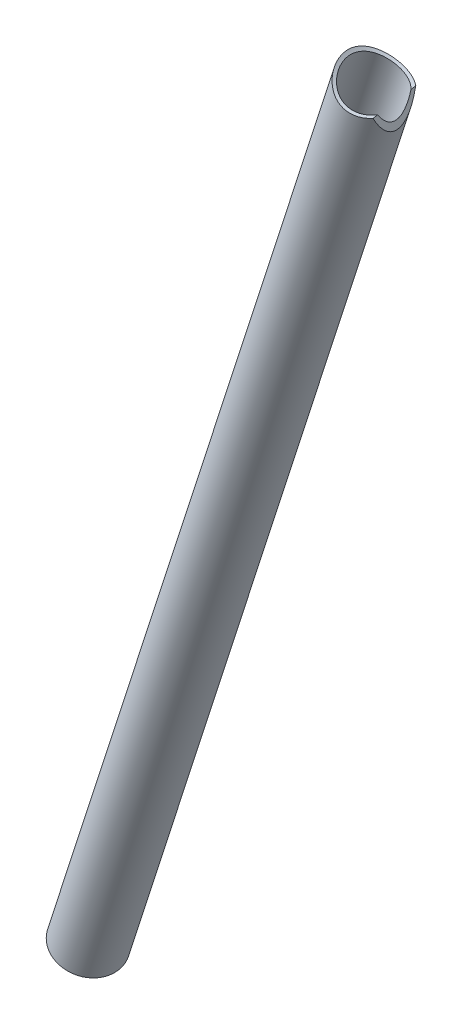
ISO-10303-21;
HEADER;
FILE_DESCRIPTION(('STEP AP214'),'2;1');
FILE_NAME('part.step','',(''),(''),'','','');
FILE_SCHEMA(('AUTOMOTIVE_DESIGN { 1 0 10303 214 1 1 1 1 }'));
ENDSEC;
DATA;
#1=APPLICATION_CONTEXT('core data for automotive mechanical design processes');
#2=APPLICATION_PROTOCOL_DEFINITION('international standard','automotive_design',2000,#1);
#3=PRODUCT_CONTEXT('',#1,'mechanical');
#4=PRODUCT('Part','Part','',(#3));
#5=PRODUCT_RELATED_PRODUCT_CATEGORY('part','',(#4));
#6=PRODUCT_DEFINITION_FORMATION('','',#4);
#7=PRODUCT_DEFINITION_CONTEXT('part definition',#1,'design');
#8=PRODUCT_DEFINITION('design','',#6,#7);
#9=PRODUCT_DEFINITION_SHAPE('','',#8);
#10=(LENGTH_UNIT() NAMED_UNIT(*) SI_UNIT(.MILLI.,.METRE.));
#11=(NAMED_UNIT(*) PLANE_ANGLE_UNIT() SI_UNIT($,.RADIAN.));
#12=(NAMED_UNIT(*) SI_UNIT($,.STERADIAN.) SOLID_ANGLE_UNIT());
#13=UNCERTAINTY_MEASURE_WITH_UNIT(LENGTH_MEASURE(1.E-05),#10,'distance_accuracy_value','');
#14=(GEOMETRIC_REPRESENTATION_CONTEXT(3) GLOBAL_UNCERTAINTY_ASSIGNED_CONTEXT((#13)) GLOBAL_UNIT_ASSIGNED_CONTEXT((#10,
#11,#12)) REPRESENTATION_CONTEXT('',''));
#15=CARTESIAN_POINT('',(0.,0.,0.));
#16=DIRECTION('',(0.,0.,1.));
#17=DIRECTION('',(1.,0.,0.));
#18=AXIS2_PLACEMENT_3D('',#15,#16,#17);
#19=CARTESIAN_POINT('',(15.0351503322684,521.737226724999,283.725227880223));
#20=DIRECTION('',(-0.025807832155009,0.13067423307069,-0.991089400917418));
#21=DIRECTION('',(-0.0275402605355425,0.99095038035367,0.131373047945732));
#22=AXIS2_PLACEMENT_3D('',#19,#20,#21);
#23=CYLINDRICAL_SURFACE('',#22,11.1125);
#24=CARTESIAN_POINT('',(17.7249998550725,509.907165659873,290.571441380771));
#25=CARTESIAN_POINT('',(17.714859230387,509.882073618332,290.736544047308));
#26=CARTESIAN_POINT('',(17.696907883389,509.855306384026,290.900855129583));
#27=CARTESIAN_POINT('',(17.6458903359661,509.799019876215,291.226688075342));
#28=CARTESIAN_POINT('',(17.6128202475326,509.769499896357,291.388209210254));
#29=CARTESIAN_POINT('',(17.5322574615317,509.708476961237,291.707417176691));
#30=CARTESIAN_POINT('',(17.4847483811448,509.67697178588,291.865099431876));
#31=CARTESIAN_POINT('',(17.376251635094,509.612936261837,292.175557086168));
#32=CARTESIAN_POINT('',(17.3152576661517,509.580405439848,292.328330152184));
#33=CARTESIAN_POINT('',(17.1145149644403,509.483259359491,292.775903107981));
#34=CARTESIAN_POINT('',(16.9562980389727,509.418546970786,293.062654205853));
#35=CARTESIAN_POINT('',(16.6878525960758,509.327274141793,293.473053956822));
#36=CARTESIAN_POINT('',(16.5931412758415,509.297805508225,293.606614085974));
#37=CARTESIAN_POINT('',(16.3941029245154,509.241685477939,293.866998838918));
#38=CARTESIAN_POINT('',(16.289775359966,509.215034237691,293.993823088422));
#39=CARTESIAN_POINT('',(15.9374228086864,509.134745421652,294.393241363527));
#40=CARTESIAN_POINT('',(15.6713683353596,509.088535725302,294.651964655292));
#41=CARTESIAN_POINT('',(15.2453680192188,509.040339512259,295.010240139479));
#42=CARTESIAN_POINT('',(15.0987607485816,509.027792354862,295.124772149783));
#43=CARTESIAN_POINT('',(14.7974877046064,509.010806345952,295.343345775861));
#44=CARTESIAN_POINT('',(14.6428254971652,509.00636393735,295.447391974795));
#45=CARTESIAN_POINT('',(14.3205551725308,509.006606728922,295.648014931001));
#46=CARTESIAN_POINT('',(14.1526786931881,509.011643257261,295.744160747586));
#47=CARTESIAN_POINT('',(13.8108651889369,509.032534295837,295.923494322964));
#48=CARTESIAN_POINT('',(13.6369311121472,509.048383611626,296.006688280254));
#49=CARTESIAN_POINT('',(13.2846121958187,509.091690144634,296.159205827002));
#50=CARTESIAN_POINT('',(13.106230547351,509.119139252566,296.228539056558));
#51=CARTESIAN_POINT('',(12.7466719058673,509.186194076586,296.352517217029));
#52=CARTESIAN_POINT('',(12.565495385847,509.225797756647,296.407164605112));
#53=CARTESIAN_POINT('',(12.2236116902249,509.311993701609,296.495497156791));
#54=CARTESIAN_POINT('',(12.0629989111602,509.357219374487,296.530890235535));
#55=CARTESIAN_POINT('',(11.7424891546355,509.457206362689,296.589240167673));
#56=CARTESIAN_POINT('',(11.5825921042142,509.511966682249,296.612198318699));
#57=CARTESIAN_POINT('',(11.2649691816409,509.630663827024,296.645422112562));
#58=CARTESIAN_POINT('',(11.1072425231125,509.694597227294,296.655692478933));
#59=CARTESIAN_POINT('',(10.7952458935019,509.831081901543,296.66347930387));
#60=CARTESIAN_POINT('',(10.6409757923459,509.903632850586,296.660996243175));
#61=CARTESIAN_POINT('',(10.3500547245036,510.050057214387,296.644129719961));
#62=CARTESIAN_POINT('',(10.213021115731,510.123293431816,296.630776279434));
#63=CARTESIAN_POINT('',(9.94364829601323,510.275625745229,296.593668789171));
#64=CARTESIAN_POINT('',(9.81131056026035,510.354723658961,296.56991150183));
#65=CARTESIAN_POINT('',(9.55210108736376,510.517929260651,296.512285905842));
#66=CARTESIAN_POINT('',(9.42522781582895,510.602035526277,296.47842045697));
#67=CARTESIAN_POINT('',(9.17740376792828,510.774451172544,296.400907630534));
#68=CARTESIAN_POINT('',(9.05645532267624,510.862762181011,296.357256439858));
#69=CARTESIAN_POINT('',(8.81534180101823,511.046950348102,296.258257643286));
#70=CARTESIAN_POINT('',(8.69548654049987,511.14298766616,296.202453120458));
#71=CARTESIAN_POINT('',(8.46308098007153,511.337654626577,296.080971174874));
#72=CARTESIAN_POINT('',(8.35053318409066,511.436285141408,296.015290393278));
#73=CARTESIAN_POINT('',(8.02421157107803,511.734505715206,295.804089058834));
#74=CARTESIAN_POINT('',(7.82165162950013,511.936508680667,295.644364651409));
#75=CARTESIAN_POINT('',(7.42399571068102,512.363652840799,295.267987167036));
#76=CARTESIAN_POINT('',(7.2329793231602,512.588538674369,295.046719106405));
#77=CARTESIAN_POINT('',(6.97567176313771,512.914813147359,294.68434736889));
#78=CARTESIAN_POINT('',(6.89471206034872,513.021820777598,294.558350608097));
#79=CARTESIAN_POINT('',(6.74248903169756,513.230577954175,294.296413045115));
#80=CARTESIAN_POINT('',(6.67122745167514,513.332326551751,294.160470459249));
#81=CARTESIAN_POINT('',(6.5343884415956,513.534836060178,293.870386277599));
#82=CARTESIAN_POINT('',(6.46943058087972,513.63515095508,293.71563956413));
#83=CARTESIAN_POINT('',(6.35065968628477,513.825606308438,293.396035121229));
#84=CARTESIAN_POINT('',(6.29684051665896,513.915752355884,293.231183023568));
#85=CARTESIAN_POINT('',(6.20056109467418,514.083534330018,292.892363224514));
#86=CARTESIAN_POINT('',(6.15808354889632,514.16118923017,292.718409890499));
#87=CARTESIAN_POINT('',(6.08462680766508,514.301946680904,292.362378177912));
#88=CARTESIAN_POINT('',(6.05364466850471,514.365052955481,292.180301892835));
#89=CARTESIAN_POINT('',(6.00677195134535,514.467510887185,291.834461273667));
#90=CARTESIAN_POINT('',(5.98941836088259,514.508909556073,291.671499350834));
#91=CARTESIAN_POINT('',(5.9636467393029,514.578514599028,291.342088143335));
#92=CARTESIAN_POINT('',(5.95522783078424,514.606722268321,291.175639202737));
#93=CARTESIAN_POINT('',(5.94739804841536,514.649507128915,290.840842348762));
#94=CARTESIAN_POINT('',(5.94798453961972,514.664088305952,290.672495005256));
#95=CARTESIAN_POINT('',(5.95816141062504,514.679701691528,290.335456385343));
#96=CARTESIAN_POINT('',(5.96775143140835,514.680734440291,290.166765122916));
#97=CARTESIAN_POINT('',(5.99412706938564,514.670471120808,289.851472665182));
#98=CARTESIAN_POINT('',(6.0098706068584,514.660690933592,289.704730994625));
#99=CARTESIAN_POINT('',(6.04815093736115,514.631760620785,289.413052106815));
#100=CARTESIAN_POINT('',(6.07068989484685,514.612607508547,289.268115479839));
#101=CARTESIAN_POINT('',(6.14840060285216,514.542174233841,288.83730054042));
#102=CARTESIAN_POINT('',(6.21368068956701,514.477912944466,288.555243469187));
#103=CARTESIAN_POINT('',(6.37875682201594,514.313579232983,287.978535505324));
#104=CARTESIAN_POINT('',(6.48142140420553,514.210493637668,287.685592677146));
#105=CARTESIAN_POINT('',(6.71888917292427,513.9795177307,287.123189504661));
#106=CARTESIAN_POINT('',(6.85371535617576,513.851609682343,286.853746152468));
#107=CARTESIAN_POINT('',(7.09242861865993,513.636259380239,286.449765004685));
#108=CARTESIAN_POINT('',(7.18570595605749,513.554238771912,286.305898246776));
#109=CARTESIAN_POINT('',(7.38322528161571,513.38607311708,286.028493316207));
#110=CARTESIAN_POINT('',(7.48746392893785,513.299929331592,285.894952017915));
#111=CARTESIAN_POINT('',(7.70698498143694,513.124879016912,285.639023597736));
#112=CARTESIAN_POINT('',(7.82227535650785,513.035970525663,285.516644651532));
#113=CARTESIAN_POINT('',(8.0636712359589,512.856889360257,285.284215598176));
#114=CARTESIAN_POINT('',(8.18977141716549,512.766717326413,285.174159483657));
#115=CARTESIAN_POINT('',(8.45336272533979,512.585904028778,284.966768139212));
#116=CARTESIAN_POINT('',(8.59091865716903,512.495263258773,284.869514619399));
#117=CARTESIAN_POINT('',(8.87616750726093,512.315514265509,284.689716042393));
#118=CARTESIAN_POINT('',(9.02385527801145,512.226405292377,284.60716359182));
#119=CARTESIAN_POINT('',(9.3285109865852,512.051123536663,284.457885506067));
#120=CARTESIAN_POINT('',(9.485471590707,511.964948516502,284.391147567418));
#121=CARTESIAN_POINT('',(9.807646771498,511.796788998659,284.274430178391));
#122=CARTESIAN_POINT('',(9.97285999299145,511.714803817402,284.22444798685));
#123=CARTESIAN_POINT('',(10.28901507026,511.566131333218,284.147179434937));
#124=CARTESIAN_POINT('',(10.4391609612044,511.498812512007,284.11783766061));
#125=CARTESIAN_POINT('',(10.7435308053061,511.36898014028,284.072933659294));
#126=CARTESIAN_POINT('',(10.897754403902,511.306466173813,284.057370238293));
#127=CARTESIAN_POINT('',(11.2089865872444,511.186801914461,284.040176022547));
#128=CARTESIAN_POINT('',(11.3659944947662,511.129650337998,284.038541885137));
#129=CARTESIAN_POINT('',(11.6815098250791,511.02107086416,284.04913908054));
#130=CARTESIAN_POINT('',(11.8400172241369,510.969642876358,284.061370194264));
#131=CARTESIAN_POINT('',(12.1464817968041,510.875982984891,284.098152897839));
#132=CARTESIAN_POINT('',(12.2944287869588,510.833364638502,284.121816967432));
#133=CARTESIAN_POINT('',(12.5894730065821,510.753280982925,284.180643296128));
#134=CARTESIAN_POINT('',(12.7365699536845,510.715817301236,284.215809174955));
#135=CARTESIAN_POINT('',(13.0288475147009,510.645964007278,284.297194095882));
#136=CARTESIAN_POINT('',(13.1740286870481,510.613572885079,284.343409838422));
#137=CARTESIAN_POINT('',(13.461637985259,510.553622045067,284.446398197088));
#138=CARTESIAN_POINT('',(13.6040650321163,510.526064188015,284.503174861813));
#139=CARTESIAN_POINT('',(14.0441127341661,510.446945283085,284.696561877481));
#140=CARTESIAN_POINT('',(14.3355630412503,510.403374384479,284.850980919031));
#141=CARTESIAN_POINT('',(14.8952506853618,510.332740342724,285.20019716571));
#142=CARTESIAN_POINT('',(15.1634696847014,510.305690140129,285.395025863862));
#143=CARTESIAN_POINT('',(15.7029809072904,510.26018085496,285.847494746764));
#144=CARTESIAN_POINT('',(15.9703731531963,510.243240610838,286.109962183653));
#145=CARTESIAN_POINT('',(16.4596533484004,510.215184179778,286.674706095112));
#146=CARTESIAN_POINT('',(16.681542152992,510.204067883366,286.976981821261));
#147=CARTESIAN_POINT('',(17.0449348325907,510.179897340051,287.574586676656));
#148=CARTESIAN_POINT('',(17.1930982883289,510.167274447136,287.865835294659));
#149=CARTESIAN_POINT('',(17.3778694038808,510.141816172698,288.31723426401));
#150=CARTESIAN_POINT('',(17.4331989857921,510.132248050575,288.470055543482));
#151=CARTESIAN_POINT('',(17.5305749976687,510.11033120189,288.779664499664));
#152=CARTESIAN_POINT('',(17.5726242234571,510.097983061526,288.936451334016));
#153=CARTESIAN_POINT('',(17.6613248817546,510.062548202856,289.337333772953));
#154=CARTESIAN_POINT('',(17.6984788627823,510.037246077111,289.583414198124));
#155=CARTESIAN_POINT('',(17.7378757925414,509.978259085139,290.07739664648));
#156=CARTESIAN_POINT('',(17.7401179660988,509.944574032796,290.325298709991));
#157=CARTESIAN_POINT('',(17.7249998550725,509.907165659873,290.571441380771));
#158=B_SPLINE_CURVE_WITH_KNOTS('',3,(#24,#25,#26,#27,#28,#29,#30,#31,#32,#33,#34,#35,#36,#37,
#38,#39,#40,#41,#42,#43,#44,#45,#46,#47,#48,#49,#50,#51,#52,#53,#54,#55,#56,#57,#58,#59,#60,#61,
#62,#63,#64,#65,#66,#67,#68,#69,#70,#71,#72,#73,#74,#75,#76,#77,#78,#79,#80,#81,#82,#83,#84,#85,
#86,#87,#88,#89,#90,#91,#92,#93,#94,#95,#96,#97,#98,#99,#100,#101,#102,#103,#104,#105,#106,#107,
#108,#109,#110,#111,#112,#113,#114,#115,#116,#117,#118,#119,#120,#121,#122,#123,#124,#125,#126,
#127,#128,#129,#130,#131,#132,#133,#134,#135,#136,#137,#138,#139,#140,#141,#142,#143,#144,#145,
#146,#147,#148,#149,#150,#151,#152,#153,#154,#155,#156,#157),.UNSPECIFIED.,.T.,.F.,(4,2,2,2,2,2,
2,2,2,2,2,2,2,2,2,2,2,2,2,2,2,2,2,2,2,2,2,2,2,2,2,2,2,2,2,2,2,2,2,2,2,2,2,2,2,2,2,2,2,2,2,2,2,2,
2,2,2,2,2,2,2,2,2,2,2,2,4),(0.,0.501638241638647,1.00340555962201,1.50574433358503,
2.00831841546365,3.00504413461366,3.50379449600191,4.0025725420516,5.11871117333861,
5.67762403724578,6.23629154114608,6.81607414182279,7.39557841162221,7.9746782248122,
8.55368108525015,9.06469890925316,9.57566339629299,10.0864375990281,10.5971925484066,
11.0645106248303,11.5319742308102,11.99930570827,12.466819603586,12.9565295861302,
13.4464064935253,14.4257332513551,15.5271653007113,16.0788811711358,16.630696229517,
17.2164656696513,17.8019115748656,18.3864596422154,18.9708579168832,19.4771995480081,
19.9834914508774,20.4896352175002,20.9957588023895,21.438997824974,21.8823781760685,
22.7686211712675,23.746397665755,24.7248754130928,25.2945299878533,25.8640114411503,
26.4339067074877,27.0035229296251,27.5766145206956,28.1494170767554,28.7217725265393,
29.294034295913,29.7947966146077,30.2955155337186,30.796114289937,31.2967051360952,
31.7635003636696,32.2304426375175,32.6972456531336,33.1642279909655,34.1579856406575,
35.1525206992159,36.27281273979,37.3930837211602,38.3696868966124,38.857586006192,
39.3453823331146,40.0932311572122,40.8410965863539),.UNSPECIFIED.);
#159=CARTESIAN_POINT('',(15.5509177758201,509.07669070958,294.749300822529));
#160=VERTEX_POINT('',#159);
#161=CARTESIAN_POINT('',(15.3105922221532,510.293544462506,285.520160320599));
#162=VERTEX_POINT('',#161);
#163=EDGE_CURVE('E83',#160,#162,#158,.T.);
#164=ORIENTED_EDGE('',*,*,#163,.F.);
#165=DIRECTION('',(-0.025807832155009,0.13067423307069,-0.991089400917418));
#166=VECTOR('',#165,1.);
#167=CARTESIAN_POINT('',(15.2259053312564,510.722344311041,282.267958451786));
#168=LINE('',#167,#166);
#169=CARTESIAN_POINT('',(15.524350461731,509.211210469802,293.729045295202));
#170=VERTEX_POINT('',#169);
#171=EDGE_CURVE('E77',#160,#170,#168,.T.);
#172=ORIENTED_EDGE('',*,*,#171,.T.);
#173=CARTESIAN_POINT('',(16.8968471225798,509.756322341458,290.520794121507));
#174=CARTESIAN_POINT('',(16.8881490656294,509.73481631836,290.669488472935));
#175=CARTESIAN_POINT('',(16.8725716192765,509.712357747174,290.81766405284));
#176=CARTESIAN_POINT('',(16.8279916668491,509.665963646829,291.111807649982));
#177=CARTESIAN_POINT('',(16.7989817493439,509.642027308632,291.257774402515));
#178=CARTESIAN_POINT('',(16.7280234402392,509.593219857145,291.54667916023));
#179=CARTESIAN_POINT('',(16.6860498251671,509.568347005257,291.689610675197));
#180=CARTESIAN_POINT('',(16.5898986420772,509.518395107501,291.971294295144));
#181=CARTESIAN_POINT('',(16.5357155520322,509.493315973298,292.110044476722));
#182=CARTESIAN_POINT('',(16.3567973458571,509.4192167369,292.517098409326));
#183=CARTESIAN_POINT('',(16.2151630472049,509.370964611312,292.778295132903));
#184=CARTESIAN_POINT('',(15.893271482059,509.28273621146,293.276823063344));
#185=CARTESIAN_POINT('',(15.7130173415898,509.242759267888,293.514156199527));
#186=CARTESIAN_POINT('',(15.3017960242732,509.173983162596,293.982570657028));
#187=CARTESIAN_POINT('',(15.067706074804,509.146532816604,294.211116130446));
#188=CARTESIAN_POINT('',(14.5674870532282,509.115773844801,294.63247757252));
#189=CARTESIAN_POINT('',(14.3013475229162,509.11247312115,294.82528182594));
#190=CARTESIAN_POINT('',(13.88041700052,509.130502131093,295.086289487902));
#191=CARTESIAN_POINT('',(13.7342588454539,509.140657514877,295.169557377237));
#192=CARTESIAN_POINT('',(13.4368277285781,509.169702210946,295.324600881387));
#193=CARTESIAN_POINT('',(13.2855570916264,509.188587601577,295.39638163693));
#194=CARTESIAN_POINT('',(12.9792822391954,509.235630480507,295.527716703735));
#195=CARTESIAN_POINT('',(12.8242798322433,509.263783558029,295.587276809332));
#196=CARTESIAN_POINT('',(12.5119286548967,509.329702118646,295.693542080606));
#197=CARTESIAN_POINT('',(12.3545801754459,509.367466419006,295.740248826518));
#198=CARTESIAN_POINT('',(12.054028860786,509.448660817537,295.816451388816));
#199=CARTESIAN_POINT('',(11.9108954895621,509.491217378242,295.847157107682));
#200=CARTESIAN_POINT('',(11.6251895743799,509.584148304187,295.897243474702));
#201=CARTESIAN_POINT('',(11.4826169867914,509.634522048383,295.916625021935));
#202=CARTESIAN_POINT('',(11.1992718944608,509.742747231089,295.943866703214));
#203=CARTESIAN_POINT('',(11.0584988503328,509.800596368334,295.951730373837));
#204=CARTESIAN_POINT('',(10.77985664994,509.923273936139,295.955896102551));
#205=CARTESIAN_POINT('',(10.6419874127712,509.988102171945,295.952198483186));
#206=CARTESIAN_POINT('',(10.3794013692438,510.119460971318,295.933972031383));
#207=CARTESIAN_POINT('',(10.2544255311667,510.185580125509,295.92019237553));
#208=CARTESIAN_POINT('',(10.0086219761797,510.322667585782,295.882830789196));
#209=CARTESIAN_POINT('',(9.88779559120391,510.393637427426,295.859245742537));
#210=CARTESIAN_POINT('',(9.65099941420374,510.539667231999,295.802525858261));
#211=CARTESIAN_POINT('',(9.53502829070764,510.614726060426,295.769393658695));
#212=CARTESIAN_POINT('',(9.30840515314363,510.768180890576,295.693884569226));
#213=CARTESIAN_POINT('',(9.19775519600021,510.846578161061,295.651504138876));
#214=CARTESIAN_POINT('',(8.86508337710226,511.092502656109,295.506897096533));
#215=CARTESIAN_POINT('',(8.65257257763375,511.264388228374,295.389651062018));
#216=CARTESIAN_POINT('',(8.25506730129975,511.611668168757,295.11946562629));
#217=CARTESIAN_POINT('',(8.07008688088961,511.787064277791,294.966508093186));
#218=CARTESIAN_POINT('',(7.71114344104504,512.151599179525,294.610367443338));
#219=CARTESIAN_POINT('',(7.54024420387194,512.340307902196,294.403646673465));
#220=CARTESIAN_POINT('',(7.23379504113021,512.702442921231,293.953255674883));
#221=CARTESIAN_POINT('',(7.09826574309886,512.875860260895,293.709564015379));
#222=CARTESIAN_POINT('',(6.92049436418218,513.118379760714,293.315170311224));
#223=CARTESIAN_POINT('',(6.86481089730517,513.19741173387,293.17640049692));
#224=CARTESIAN_POINT('',(6.76338825766212,513.34668137349,292.890760808819));
#225=CARTESIAN_POINT('',(6.71764424442276,513.416923313564,292.743894921664));
#226=CARTESIAN_POINT('',(6.63635380503089,513.546985833813,292.443084792429));
#227=CARTESIAN_POINT('',(6.60079704545172,513.606816949821,292.289147908087));
#228=CARTESIAN_POINT('',(6.54005083439427,513.714711655403,291.975222399907));
#229=CARTESIAN_POINT('',(6.51485959596312,513.762777272698,291.815234824368));
#230=CARTESIAN_POINT('',(6.47729346209932,513.841296437923,291.509003960741));
#231=CARTESIAN_POINT('',(6.46379217790996,513.873126218758,291.363249848467));
#232=CARTESIAN_POINT('',(6.44519877888789,513.92610712612,291.069288925678));
#233=CARTESIAN_POINT('',(6.44010592149986,513.94725919549,290.921082332912));
#234=CARTESIAN_POINT('',(6.4383706118643,513.978667642019,290.623497330815));
#235=CARTESIAN_POINT('',(6.44172684188182,513.98892571787,290.474119107836));
#236=CARTESIAN_POINT('',(6.45686751407201,513.998667740281,290.175446372785));
#237=CARTESIAN_POINT('',(6.46865181055056,513.998151873084,290.026151859312));
#238=CARTESIAN_POINT('',(6.49928396584223,513.987225964279,289.740920747696));
#239=CARTESIAN_POINT('',(6.51748194167633,513.977621199824,289.604882184025));
#240=CARTESIAN_POINT('',(6.56085388414364,513.950181412794,289.334748280558));
#241=CARTESIAN_POINT('',(6.58603001561072,513.932343835007,289.200653557408));
#242=CARTESIAN_POINT('',(6.67189442760122,513.867399979764,288.802515977443));
#243=CARTESIAN_POINT('',(6.7429375195604,513.808854478371,288.54244447651));
#244=CARTESIAN_POINT('',(6.91936580418254,513.66085616496,288.016159204838));
#245=CARTESIAN_POINT('',(7.02723009226011,513.569130141117,287.751431921756));
#246=CARTESIAN_POINT('',(7.27423586057665,513.364192065009,287.245901672344));
#247=CARTESIAN_POINT('',(7.41339731209977,513.250966300587,287.0051141245));
#248=CARTESIAN_POINT('',(7.74107266073733,512.995970918775,286.52525620848));
#249=CARTESIAN_POINT('',(7.93347213863691,512.852409718055,286.28974004566));
#250=CARTESIAN_POINT('',(8.25001129502225,512.631061206482,285.968598014947));
#251=CARTESIAN_POINT('',(8.36025521871942,512.556230755175,285.866854887013));
#252=CARTESIAN_POINT('',(8.58980694700288,512.405688638657,285.674941653837));
#253=CARTESIAN_POINT('',(8.70911027905978,512.329977423703,285.584765896292));
#254=CARTESIAN_POINT('',(8.95479478589409,512.179766462754,285.417953111676));
#255=CARTESIAN_POINT('',(9.08106799489567,512.10526346143,285.341159986841));
#256=CARTESIAN_POINT('',(9.34136200399991,511.957620695946,285.200636683551));
#257=CARTESIAN_POINT('',(9.47537907151969,511.884480297118,285.136900277922));
#258=CARTESIAN_POINT('',(9.75030443731193,511.740606975028,285.023280362687));
#259=CARTESIAN_POINT('',(9.89120904219163,511.669872795225,284.973389522296));
#260=CARTESIAN_POINT('',(10.1789108748645,511.531739769228,284.888093040879));
#261=CARTESIAN_POINT('',(10.3257074277563,511.464340542991,284.852685745985));
#262=CARTESIAN_POINT('',(10.6085692364471,511.340449548428,284.799711289483));
#263=CARTESIAN_POINT('',(10.7441838920199,511.283549130726,284.780683009646));
#264=CARTESIAN_POINT('',(11.0181151195147,511.173614556592,284.75485755613));
#265=CARTESIAN_POINT('',(11.156431545563,511.120580192152,284.748059723941));
#266=CARTESIAN_POINT('',(11.4346537464265,511.018768638485,284.746726461696));
#267=CARTESIAN_POINT('',(11.5745592823344,510.969990818657,284.752189212036));
#268=CARTESIAN_POINT('',(11.8548601366527,510.87693034422,284.775242165893));
#269=CARTESIAN_POINT('',(11.9952554556038,510.832647694576,284.792832382801));
#270=CARTESIAN_POINT('',(12.2697206063266,510.750397167824,284.838909940945));
#271=CARTESIAN_POINT('',(12.403815053154,510.712245490788,284.866923982552));
#272=CARTESIAN_POINT('',(12.6705175189961,510.6401450562,284.933511182735));
#273=CARTESIAN_POINT('',(12.803125043977,510.606197659979,284.972087748498));
#274=CARTESIAN_POINT('',(13.1973046708773,510.510523889648,285.103050063596));
#275=CARTESIAN_POINT('',(13.455443820596,510.454904093293,285.210704371783));
#276=CARTESIAN_POINT('',(13.9727690744957,510.354764481891,285.471400373458));
#277=CARTESIAN_POINT('',(14.2308330883007,510.311256458531,285.627030297698));
#278=CARTESIAN_POINT('',(14.7224692268367,510.236780390448,285.975610007646));
#279=CARTESIAN_POINT('',(14.9560258933517,510.205820225572,286.168583132246));
#280=CARTESIAN_POINT('',(15.4141475296326,510.149153520375,286.608313738872));
#281=CARTESIAN_POINT('',(15.6355673412428,510.124263493312,286.858494825341));
#282=CARTESIAN_POINT('',(15.9336146056076,510.08902828937,287.259064165856));
#283=CARTESIAN_POINT('',(16.0273466973547,510.07762462965,287.396928144028));
#284=CARTESIAN_POINT('',(16.2023398243649,510.054650393987,287.680315325481));
#285=CARTESIAN_POINT('',(16.2836071256554,510.04307990513,287.825834630706));
#286=CARTESIAN_POINT('',(16.4321566524965,510.019013606796,288.122833965608));
#287=CARTESIAN_POINT('',(16.4995088672913,510.006522879252,288.274279369061));
#288=CARTESIAN_POINT('',(16.6196188700146,509.979848888194,288.582634987415));
#289=CARTESIAN_POINT('',(16.6723848116206,509.965666576643,288.739542093785));
#290=CARTESIAN_POINT('',(16.7622524627016,509.935077901458,289.057136722981));
#291=CARTESIAN_POINT('',(16.7993944738502,509.918677405986,289.217813376528));
#292=CARTESIAN_POINT('',(16.8574181056687,509.883286702037,289.541712586784));
#293=CARTESIAN_POINT('',(16.8783111526911,509.864298324435,289.704933271981));
#294=CARTESIAN_POINT('',(16.8992172972517,509.830502354219,289.977219621801));
#295=CARTESIAN_POINT('',(16.9038889685475,509.816435804734,290.086040978244));
#296=CARTESIAN_POINT('',(16.9058759573425,509.787189182677,290.303598264666));
#297=CARTESIAN_POINT('',(16.9031916177072,509.772009162036,290.41233419839));
#298=CARTESIAN_POINT('',(16.8968471225798,509.756322341458,290.520794121507));
#299=B_SPLINE_CURVE_WITH_KNOTS('',3,(#173,#174,#175,#176,#177,#178,#179,#180,#181,#182,#183,
#184,#185,#186,#187,#188,#189,#190,#191,#192,#193,#194,#195,#196,#197,#198,#199,#200,#201,#202,
#203,#204,#205,#206,#207,#208,#209,#210,#211,#212,#213,#214,#215,#216,#217,#218,#219,#220,#221,
#222,#223,#224,#225,#226,#227,#228,#229,#230,#231,#232,#233,#234,#235,#236,#237,#238,#239,#240,
#241,#242,#243,#244,#245,#246,#247,#248,#249,#250,#251,#252,#253,#254,#255,#256,#257,#258,#259,
#260,#261,#262,#263,#264,#265,#266,#267,#268,#269,#270,#271,#272,#273,#274,#275,#276,#277,#278,
#279,#280,#281,#282,#283,#284,#285,#286,#287,#288,#289,#290,#291,#292,#293,#294,#295,#296,#297,
#298),.UNSPECIFIED.,.T.,.F.,(4,2,2,2,2,2,2,2,2,2,2,2,2,2,2,2,2,2,2,2,2,2,2,2,2,2,2,2,2,2,2,2,2,
2,2,2,2,2,2,2,2,2,2,2,2,2,2,2,2,2,2,2,2,2,2,2,2,2,2,2,2,2,4),(0.,0.451359945270174,
0.902969227867048,1.35546280219681,1.80816143979419,2.70707783433345,3.60592149492127,
4.5865885919745,5.56757656533724,6.07255689084223,6.57731059143344,7.08182441073765,
7.58627617570744,8.04302278331659,8.49973312277311,8.95630319939142,9.41286053846909,
9.83855100134655,10.2643768532625,10.6900851544684,11.1159567140118,12.0041954127729,
12.892886083774,13.8725048754158,14.8526937046168,15.3594814023521,15.8660217406259,
16.3720464364458,16.8779838600971,17.3267639254178,17.7755043564691,18.2241748054877,
18.6728374986275,19.0851376303851,19.4975658134905,20.3218987445689,21.2190430849409,
22.1167615418659,23.120393176673,23.6228095566417,24.1249794919432,24.6208298378946,
25.1164431432489,25.6117935343142,26.1070873458106,26.5514024945132,26.9956937197398,
27.4399190116341,27.8841447940028,28.3102672172265,28.7365272584332,29.58838937973,
30.4981693171066,31.4085196992958,32.4084311436714,32.9092163231834,33.4097489279451,
33.9076991635278,34.4053704811267,34.9017500726685,35.3977802912007,35.7270244510459,
36.0562532649982),.UNSPECIFIED.);
#300=CARTESIAN_POINT('',(15.3371595362423,510.159024702284,286.540415847926));
#301=VERTEX_POINT('',#300);
#302=EDGE_CURVE('E76',#170,#301,#299,.T.);
#303=ORIENTED_EDGE('',*,*,#302,.T.);
#304=EDGE_CURVE('E70',#301,#162,#168,.T.);
#305=ORIENTED_EDGE('',*,*,#304,.T.);
#306=EDGE_LOOP('',(#164,#172,#303,#305));
#307=FACE_BOUND('',#306,.T.);
#308=ADVANCED_FACE('F44',(#307),#23,.F.);
#309=CARTESIAN_POINT('',(11.1000153211224,510.462537886471,290.350004596337));
#310=DIRECTION('',(-0.372552052092472,-0.921256433163449,-0.111765615627742));
#311=DIRECTION('',(0.927064869160757,-0.374900958078196,0.));
#312=AXIS2_PLACEMENT_3D('',#309,#310,#311);
#313=CYLINDRICAL_SURFACE('',#312,6.35000000000002);
#314=CARTESIAN_POINT('',(-74.5126716724866,298.757252114231,264.666198498254));
#315=DIRECTION('',(0.372552052092472,0.921256433163449,0.111765615627742));
#316=DIRECTION('',(-0.927064869160757,0.374900958078196,0.));
#317=AXIS2_PLACEMENT_3D('',#314,#315,#316);
#318=CIRCLE('',#317,6.35000000000002);
#319=CARTESIAN_POINT('',(-80.3995335916574,301.137873198028,264.666198498254));
#320=VERTEX_POINT('',#319);
#321=EDGE_CURVE('E48',#320,#320,#318,.T.);
#322=ORIENTED_EDGE('',*,*,#321,.T.);
#323=EDGE_LOOP('',(#322));
#324=FACE_BOUND('',#323,.T.);
#325=ORIENTED_EDGE('',*,*,#163,.T.);
#326=CARTESIAN_POINT('',(15.2399999999989,520.699999999997,291.592));
#327=DIRECTION('',(-0.999519530057415,-0.0203972303696372,0.0233379953520305));
#328=DIRECTION('',(0.0171658041833844,-0.991215515316742,-0.131137856327235));
#329=AXIS2_PLACEMENT_3D('',#326,#327,#328);
#330=ELLIPSE('',#329,16.3425713307167,6.35000000000002);
#331=EDGE_CURVE('E62',#162,#160,#330,.T.);
#332=ORIENTED_EDGE('',*,*,#331,.T.);
#333=EDGE_LOOP('',(#325,#332));
#334=FACE_BOUND('',#333,.T.);
#335=ADVANCED_FACE('F98',(#324,#334),#313,.T.);
#336=CARTESIAN_POINT('',(11.1000153211224,510.462537886471,290.350004596337));
#337=DIRECTION('',(-0.372552052092472,-0.921256433163449,-0.111765615627742));
#338=DIRECTION('',(0.927064869160757,-0.374900958078196,0.));
#339=AXIS2_PLACEMENT_3D('',#336,#337,#338);
#340=CYLINDRICAL_SURFACE('',#339,5.6388);
#341=CARTESIAN_POINT('',(-74.5126716724866,298.757252114231,264.666198498254));
#342=DIRECTION('',(0.372552052092472,0.921256433163449,0.111765615627742));
#343=DIRECTION('',(-0.927064869160757,0.374900958078196,0.));
#344=AXIS2_PLACEMENT_3D('',#341,#342,#343);
#345=CIRCLE('',#344,5.6388);
#346=CARTESIAN_POINT('',(-79.7402050567103,300.871243636643,264.666198498254));
#347=VERTEX_POINT('',#346);
#348=EDGE_CURVE('E13',#347,#347,#345,.T.);
#349=ORIENTED_EDGE('',*,*,#348,.F.);
#350=EDGE_LOOP('',(#349));
#351=FACE_BOUND('',#350,.T.);
#352=CARTESIAN_POINT('',(15.2399999999989,520.699999999997,291.592));
#353=DIRECTION('',(-0.999519530057415,-0.0203972303696372,0.0233379953520305));
#354=DIRECTION('',(0.0171658041833844,-0.991215515316742,-0.131137856327235));
#355=AXIS2_PLACEMENT_3D('',#352,#353,#354);
#356=ELLIPSE('',#355,14.5122033416764,5.6388);
#357=EDGE_CURVE('E54',#301,#170,#356,.T.);
#358=ORIENTED_EDGE('',*,*,#357,.F.);
#359=ORIENTED_EDGE('',*,*,#302,.F.);
#360=EDGE_LOOP('',(#358,#359));
#361=FACE_BOUND('',#360,.T.);
#362=ADVANCED_FACE('F81',(#351,#361),#340,.F.);
#363=CARTESIAN_POINT('',(19.0391905947068,0.388533435248943,-0.444550134583328));
#364=DIRECTION('',(-0.999519530057415,-0.0203972303696372,0.0233379953520305));
#365=DIRECTION('',(0.0233428517189956,0.,0.999727518513732));
#366=AXIS2_PLACEMENT_3D('',#363,#364,#365);
#367=PLANE('',#366);
#368=ORIENTED_EDGE('',*,*,#304,.F.);
#369=ORIENTED_EDGE('',*,*,#357,.T.);
#370=ORIENTED_EDGE('',*,*,#171,.F.);
#371=ORIENTED_EDGE('',*,*,#331,.F.);
#372=EDGE_LOOP('',(#368,#369,#370,#371));
#373=FACE_BOUND('',#372,.T.);
#374=ADVANCED_FACE('F72',(#373),#367,.F.);
#375=CARTESIAN_POINT('',(-74.5126716724866,298.757252114231,264.666198498254));
#376=DIRECTION('',(0.372552052092472,0.921256433163449,0.111765615627742));
#377=DIRECTION('',(-0.927064869160757,0.374900958078196,0.));
#378=AXIS2_PLACEMENT_3D('',#375,#376,#377);
#379=PLANE('',#378);
#380=ORIENTED_EDGE('',*,*,#348,.T.);
#381=EDGE_LOOP('',(#380));
#382=FACE_BOUND('',#381,.T.);
#383=ORIENTED_EDGE('',*,*,#321,.F.);
#384=EDGE_LOOP('',(#383));
#385=FACE_BOUND('',#384,.T.);
#386=ADVANCED_FACE('F46',(#382,#385),#379,.F.);
#387=CLOSED_SHELL('',(#308,#335,#362,#374,#386));
#388=MANIFOLD_SOLID_BREP('B2',#387);
#389=ADVANCED_BREP_SHAPE_REPRESENTATION('',(#18,#388),#14);
#390=SHAPE_DEFINITION_REPRESENTATION(#9,#389);
ENDSEC;
END-ISO-10303-21;
